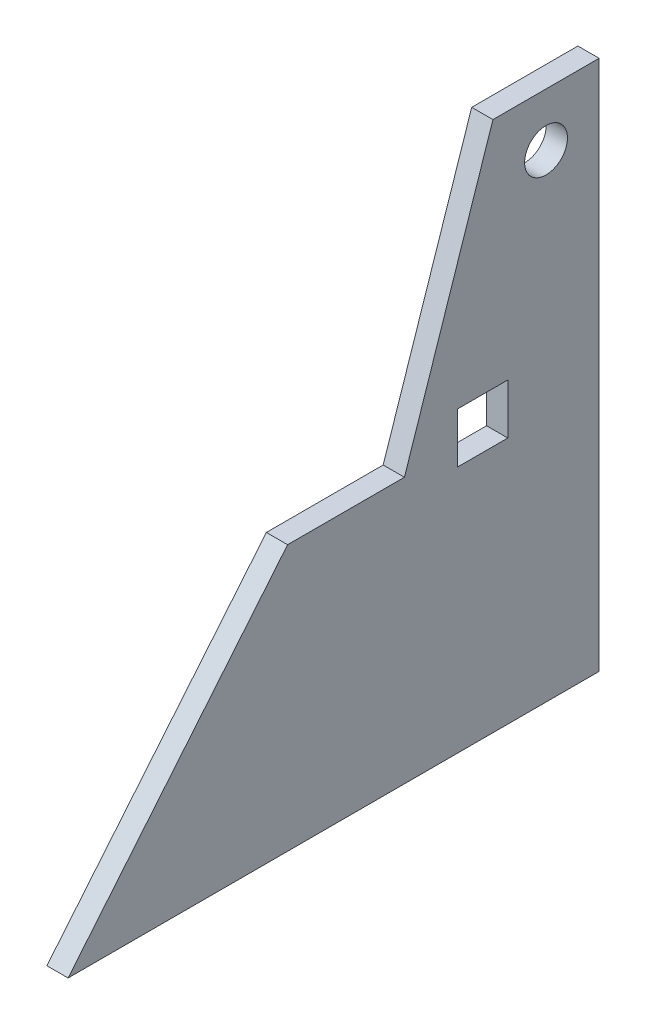
ISO-10303-21;
HEADER;
FILE_DESCRIPTION(('STEP AP214'),'2;1');
FILE_NAME('part.step','',(''),(''),'','','');
FILE_SCHEMA(('AUTOMOTIVE_DESIGN { 1 0 10303 214 1 1 1 1 }'));
ENDSEC;
DATA;
#1=APPLICATION_CONTEXT('core data for automotive mechanical design processes');
#2=APPLICATION_PROTOCOL_DEFINITION('international standard','automotive_design',2000,#1);
#3=PRODUCT_CONTEXT('',#1,'mechanical');
#4=PRODUCT('Part','Part','',(#3));
#5=PRODUCT_RELATED_PRODUCT_CATEGORY('part','',(#4));
#6=PRODUCT_DEFINITION_FORMATION('','',#4);
#7=PRODUCT_DEFINITION_CONTEXT('part definition',#1,'design');
#8=PRODUCT_DEFINITION('design','',#6,#7);
#9=PRODUCT_DEFINITION_SHAPE('','',#8);
#10=(LENGTH_UNIT() NAMED_UNIT(*) SI_UNIT(.MILLI.,.METRE.));
#11=(NAMED_UNIT(*) PLANE_ANGLE_UNIT() SI_UNIT($,.RADIAN.));
#12=(NAMED_UNIT(*) SI_UNIT($,.STERADIAN.) SOLID_ANGLE_UNIT());
#13=UNCERTAINTY_MEASURE_WITH_UNIT(LENGTH_MEASURE(1.E-05),#10,'distance_accuracy_value','');
#14=(GEOMETRIC_REPRESENTATION_CONTEXT(3) GLOBAL_UNCERTAINTY_ASSIGNED_CONTEXT((#13)) GLOBAL_UNIT_ASSIGNED_CONTEXT((#10,
#11,#12)) REPRESENTATION_CONTEXT('',''));
#15=CARTESIAN_POINT('',(0.,0.,0.));
#16=DIRECTION('',(0.,0.,1.));
#17=DIRECTION('',(1.,0.,0.));
#18=AXIS2_PLACEMENT_3D('',#15,#16,#17);
#19=CARTESIAN_POINT('',(6.,0.,0.));
#20=DIRECTION('',(-1.,0.,0.));
#21=DIRECTION('',(0.,0.,1.));
#22=AXIS2_PLACEMENT_3D('',#19,#20,#21);
#23=PLANE('',#22);
#24=DIRECTION('',(0.,1.,0.));
#25=VECTOR('',#24,1.);
#26=CARTESIAN_POINT('',(6.,0.,0.));
#27=LINE('',#26,#25);
#28=CARTESIAN_POINT('',(6.,0.,0.));
#29=VERTEX_POINT('',#28);
#30=CARTESIAN_POINT('',(6.,150.,0.));
#31=VERTEX_POINT('',#30);
#32=EDGE_CURVE('E151',#29,#31,#27,.T.);
#33=ORIENTED_EDGE('',*,*,#32,.T.);
#34=DIRECTION('',(0.,0.,1.));
#35=VECTOR('',#34,1.);
#36=CARTESIAN_POINT('',(6.,150.,30.));
#37=LINE('',#36,#35);
#38=CARTESIAN_POINT('',(6.,150.,30.));
#39=VERTEX_POINT('',#38);
#40=EDGE_CURVE('E154',#31,#39,#37,.T.);
#41=ORIENTED_EDGE('',*,*,#40,.T.);
#42=DIRECTION('',(0.,-0.948683298050514,0.316227766016838));
#43=VECTOR('',#42,1.);
#44=CARTESIAN_POINT('',(6.,150.,30.));
#45=LINE('',#44,#43);
#46=CARTESIAN_POINT('',(6.,75.,55.));
#47=VERTEX_POINT('',#46);
#48=EDGE_CURVE('E157',#39,#47,#45,.T.);
#49=ORIENTED_EDGE('',*,*,#48,.T.);
#50=DIRECTION('',(0.,0.,1.));
#51=VECTOR('',#50,1.);
#52=CARTESIAN_POINT('',(6.,75.,55.));
#53=LINE('',#52,#51);
#54=CARTESIAN_POINT('',(6.,75.,88.));
#55=VERTEX_POINT('',#54);
#56=EDGE_CURVE('E159',#47,#55,#53,.T.);
#57=ORIENTED_EDGE('',*,*,#56,.T.);
#58=DIRECTION('',(0.,-0.770742318559135,0.637146983342218));
#59=VECTOR('',#58,1.);
#60=CARTESIAN_POINT('',(6.,0.,150.));
#61=LINE('',#60,#59);
#62=CARTESIAN_POINT('',(6.,0.,150.));
#63=VERTEX_POINT('',#62);
#64=EDGE_CURVE('E161',#55,#63,#61,.T.);
#65=ORIENTED_EDGE('',*,*,#64,.T.);
#66=DIRECTION('',(0.,0.,-1.));
#67=VECTOR('',#66,1.);
#68=CARTESIAN_POINT('',(6.,0.,150.));
#69=LINE('',#68,#67);
#70=EDGE_CURVE('E163',#63,#29,#69,.T.);
#71=ORIENTED_EDGE('',*,*,#70,.T.);
#72=EDGE_LOOP('',(#33,#41,#49,#57,#65,#71));
#73=FACE_BOUND('',#72,.T.);
#74=DIRECTION('',(0.,-1.,0.));
#75=VECTOR('',#74,1.);
#76=CARTESIAN_POINT('',(6.,70.,40.));
#77=LINE('',#76,#75);
#78=CARTESIAN_POINT('',(6.,84.2,40.));
#79=VERTEX_POINT('',#78);
#80=CARTESIAN_POINT('',(6.,70.,40.));
#81=VERTEX_POINT('',#80);
#82=EDGE_CURVE('E112',#79,#81,#77,.T.);
#83=ORIENTED_EDGE('',*,*,#82,.F.);
#84=DIRECTION('',(0.,0.,1.));
#85=VECTOR('',#84,1.);
#86=CARTESIAN_POINT('',(6.,84.2,25.8));
#87=LINE('',#86,#85);
#88=CARTESIAN_POINT('',(6.,84.2,25.8));
#89=VERTEX_POINT('',#88);
#90=EDGE_CURVE('E135',#89,#79,#87,.T.);
#91=ORIENTED_EDGE('',*,*,#90,.F.);
#92=DIRECTION('',(0.,1.,0.));
#93=VECTOR('',#92,1.);
#94=CARTESIAN_POINT('',(6.,70.,25.8));
#95=LINE('',#94,#93);
#96=CARTESIAN_POINT('',(6.,70.,25.8));
#97=VERTEX_POINT('',#96);
#98=EDGE_CURVE('E133',#97,#89,#95,.T.);
#99=ORIENTED_EDGE('',*,*,#98,.F.);
#100=DIRECTION('',(0.,0.,-1.));
#101=VECTOR('',#100,1.);
#102=CARTESIAN_POINT('',(6.,70.,25.8));
#103=LINE('',#102,#101);
#104=EDGE_CURVE('E120',#81,#97,#103,.T.);
#105=ORIENTED_EDGE('',*,*,#104,.F.);
#106=EDGE_LOOP('',(#83,#91,#99,#105));
#107=FACE_BOUND('',#106,.T.);
#108=CARTESIAN_POINT('',(6.,135.,15.));
#109=DIRECTION('',(1.,0.,0.));
#110=DIRECTION('',(0.,0.,-1.));
#111=AXIS2_PLACEMENT_3D('',#108,#109,#110);
#112=CIRCLE('',#111,6.05);
#113=CARTESIAN_POINT('',(6.,135.,8.95));
#114=VERTEX_POINT('',#113);
#115=EDGE_CURVE('E141',#114,#114,#112,.T.);
#116=ORIENTED_EDGE('',*,*,#115,.F.);
#117=EDGE_LOOP('',(#116));
#118=FACE_BOUND('',#117,.T.);
#119=ADVANCED_FACE('F35',(#73,#107,#118),#23,.F.);
#120=CARTESIAN_POINT('',(0.,0.,0.));
#121=DIRECTION('',(-1.,0.,0.));
#122=DIRECTION('',(0.,0.,1.));
#123=AXIS2_PLACEMENT_3D('',#120,#121,#122);
#124=PLANE('',#123);
#125=DIRECTION('',(0.,0.,1.));
#126=VECTOR('',#125,1.);
#127=CARTESIAN_POINT('',(0.,84.2,25.8));
#128=LINE('',#127,#126);
#129=CARTESIAN_POINT('',(0.,84.2,25.8));
#130=VERTEX_POINT('',#129);
#131=CARTESIAN_POINT('',(0.,84.2,40.));
#132=VERTEX_POINT('',#131);
#133=EDGE_CURVE('E121',#130,#132,#128,.T.);
#134=ORIENTED_EDGE('',*,*,#133,.T.);
#135=DIRECTION('',(0.,-1.,0.));
#136=VECTOR('',#135,1.);
#137=CARTESIAN_POINT('',(0.,70.,40.));
#138=LINE('',#137,#136);
#139=CARTESIAN_POINT('',(0.,70.,40.));
#140=VERTEX_POINT('',#139);
#141=EDGE_CURVE('E58',#132,#140,#138,.T.);
#142=ORIENTED_EDGE('',*,*,#141,.T.);
#143=DIRECTION('',(0.,0.,-1.));
#144=VECTOR('',#143,1.);
#145=CARTESIAN_POINT('',(0.,70.,25.8));
#146=LINE('',#145,#144);
#147=CARTESIAN_POINT('',(0.,70.,25.8));
#148=VERTEX_POINT('',#147);
#149=EDGE_CURVE('E127',#140,#148,#146,.T.);
#150=ORIENTED_EDGE('',*,*,#149,.T.);
#151=DIRECTION('',(0.,1.,0.));
#152=VECTOR('',#151,1.);
#153=CARTESIAN_POINT('',(0.,70.,25.8));
#154=LINE('',#153,#152);
#155=EDGE_CURVE('E143',#148,#130,#154,.T.);
#156=ORIENTED_EDGE('',*,*,#155,.T.);
#157=EDGE_LOOP('',(#134,#142,#150,#156));
#158=FACE_BOUND('',#157,.T.);
#159=DIRECTION('',(0.,1.,0.));
#160=VECTOR('',#159,1.);
#161=CARTESIAN_POINT('',(0.,0.,0.));
#162=LINE('',#161,#160);
#163=CARTESIAN_POINT('',(0.,0.,0.));
#164=VERTEX_POINT('',#163);
#165=CARTESIAN_POINT('',(0.,150.,0.));
#166=VERTEX_POINT('',#165);
#167=EDGE_CURVE('E128',#164,#166,#162,.T.);
#168=ORIENTED_EDGE('',*,*,#167,.F.);
#169=DIRECTION('',(0.,0.,-1.));
#170=VECTOR('',#169,1.);
#171=CARTESIAN_POINT('',(0.,0.,150.));
#172=LINE('',#171,#170);
#173=CARTESIAN_POINT('',(0.,0.,150.));
#174=VERTEX_POINT('',#173);
#175=EDGE_CURVE('E155',#174,#164,#172,.T.);
#176=ORIENTED_EDGE('',*,*,#175,.F.);
#177=DIRECTION('',(0.,-0.770742318559135,0.637146983342218));
#178=VECTOR('',#177,1.);
#179=CARTESIAN_POINT('',(0.,0.,150.));
#180=LINE('',#179,#178);
#181=CARTESIAN_POINT('',(0.,75.,88.));
#182=VERTEX_POINT('',#181);
#183=EDGE_CURVE('E174',#182,#174,#180,.T.);
#184=ORIENTED_EDGE('',*,*,#183,.F.);
#185=DIRECTION('',(0.,0.,1.));
#186=VECTOR('',#185,1.);
#187=CARTESIAN_POINT('',(0.,75.,55.));
#188=LINE('',#187,#186);
#189=CARTESIAN_POINT('',(0.,75.,55.));
#190=VERTEX_POINT('',#189);
#191=EDGE_CURVE('E172',#190,#182,#188,.T.);
#192=ORIENTED_EDGE('',*,*,#191,.F.);
#193=DIRECTION('',(0.,-0.948683298050514,0.316227766016838));
#194=VECTOR('',#193,1.);
#195=CARTESIAN_POINT('',(0.,150.,30.));
#196=LINE('',#195,#194);
#197=CARTESIAN_POINT('',(0.,150.,30.));
#198=VERTEX_POINT('',#197);
#199=EDGE_CURVE('E170',#198,#190,#196,.T.);
#200=ORIENTED_EDGE('',*,*,#199,.F.);
#201=DIRECTION('',(0.,0.,1.));
#202=VECTOR('',#201,1.);
#203=CARTESIAN_POINT('',(0.,150.,30.));
#204=LINE('',#203,#202);
#205=EDGE_CURVE('E168',#166,#198,#204,.T.);
#206=ORIENTED_EDGE('',*,*,#205,.F.);
#207=EDGE_LOOP('',(#168,#176,#184,#192,#200,#206));
#208=FACE_BOUND('',#207,.T.);
#209=CARTESIAN_POINT('',(0.,135.,15.));
#210=DIRECTION('',(1.,0.,0.));
#211=DIRECTION('',(0.,0.,-1.));
#212=AXIS2_PLACEMENT_3D('',#209,#210,#211);
#213=CIRCLE('',#212,6.05);
#214=CARTESIAN_POINT('',(0.,135.,8.95));
#215=VERTEX_POINT('',#214);
#216=EDGE_CURVE('E254',#215,#215,#213,.T.);
#217=ORIENTED_EDGE('',*,*,#216,.T.);
#218=EDGE_LOOP('',(#217));
#219=FACE_BOUND('',#218,.T.);
#220=ADVANCED_FACE('F198',(#158,#208,#219),#124,.T.);
#221=CARTESIAN_POINT('',(6.,0.,0.));
#222=DIRECTION('',(0.,0.,1.));
#223=DIRECTION('',(1.,0.,0.));
#224=AXIS2_PLACEMENT_3D('',#221,#222,#223);
#225=PLANE('',#224);
#226=ORIENTED_EDGE('',*,*,#167,.T.);
#227=DIRECTION('',(-1.,0.,0.));
#228=VECTOR('',#227,1.);
#229=CARTESIAN_POINT('',(6.,150.,0.));
#230=LINE('',#229,#228);
#231=EDGE_CURVE('E11',#31,#166,#230,.T.);
#232=ORIENTED_EDGE('',*,*,#231,.F.);
#233=ORIENTED_EDGE('',*,*,#32,.F.);
#234=DIRECTION('',(-1.,0.,0.));
#235=VECTOR('',#234,1.);
#236=CARTESIAN_POINT('',(6.,0.,0.));
#237=LINE('',#236,#235);
#238=EDGE_CURVE('E165',#29,#164,#237,.T.);
#239=ORIENTED_EDGE('',*,*,#238,.T.);
#240=EDGE_LOOP('',(#226,#232,#233,#239));
#241=FACE_BOUND('',#240,.T.);
#242=ADVANCED_FACE('F37',(#241),#225,.F.);
#243=CARTESIAN_POINT('',(6.,150.,30.));
#244=DIRECTION('',(0.,-1.,0.));
#245=DIRECTION('',(0.,0.,-1.));
#246=AXIS2_PLACEMENT_3D('',#243,#244,#245);
#247=PLANE('',#246);
#248=ORIENTED_EDGE('',*,*,#205,.T.);
#249=DIRECTION('',(-1.,0.,0.));
#250=VECTOR('',#249,1.);
#251=CARTESIAN_POINT('',(6.,150.,30.));
#252=LINE('',#251,#250);
#253=EDGE_CURVE('E43',#39,#198,#252,.T.);
#254=ORIENTED_EDGE('',*,*,#253,.F.);
#255=ORIENTED_EDGE('',*,*,#40,.F.);
#256=ORIENTED_EDGE('',*,*,#231,.T.);
#257=EDGE_LOOP('',(#248,#254,#255,#256));
#258=FACE_BOUND('',#257,.T.);
#259=ADVANCED_FACE('F215',(#258),#247,.F.);
#260=CARTESIAN_POINT('',(6.,150.,30.));
#261=DIRECTION('',(0.,-0.316227766016838,-0.948683298050514));
#262=DIRECTION('',(0.,0.948683298050514,-0.316227766016838));
#263=AXIS2_PLACEMENT_3D('',#260,#261,#262);
#264=PLANE('',#263);
#265=ORIENTED_EDGE('',*,*,#199,.T.);
#266=DIRECTION('',(-1.,0.,0.));
#267=VECTOR('',#266,1.);
#268=CARTESIAN_POINT('',(6.,75.,55.));
#269=LINE('',#268,#267);
#270=EDGE_CURVE('E185',#47,#190,#269,.T.);
#271=ORIENTED_EDGE('',*,*,#270,.F.);
#272=ORIENTED_EDGE('',*,*,#48,.F.);
#273=ORIENTED_EDGE('',*,*,#253,.T.);
#274=EDGE_LOOP('',(#265,#271,#272,#273));
#275=FACE_BOUND('',#274,.T.);
#276=ADVANCED_FACE('F192',(#275),#264,.F.);
#277=CARTESIAN_POINT('',(6.,75.,55.));
#278=DIRECTION('',(0.,-1.,0.));
#279=DIRECTION('',(0.,0.,-1.));
#280=AXIS2_PLACEMENT_3D('',#277,#278,#279);
#281=PLANE('',#280);
#282=ORIENTED_EDGE('',*,*,#191,.T.);
#283=DIRECTION('',(-1.,0.,0.));
#284=VECTOR('',#283,1.);
#285=CARTESIAN_POINT('',(6.,75.,88.));
#286=LINE('',#285,#284);
#287=EDGE_CURVE('E182',#55,#182,#286,.T.);
#288=ORIENTED_EDGE('',*,*,#287,.F.);
#289=ORIENTED_EDGE('',*,*,#56,.F.);
#290=ORIENTED_EDGE('',*,*,#270,.T.);
#291=EDGE_LOOP('',(#282,#288,#289,#290));
#292=FACE_BOUND('',#291,.T.);
#293=ADVANCED_FACE('F204',(#292),#281,.F.);
#294=CARTESIAN_POINT('',(6.,0.,150.));
#295=DIRECTION('',(0.,-0.637146983342218,-0.770742318559135));
#296=DIRECTION('',(0.,0.770742318559135,-0.637146983342218));
#297=AXIS2_PLACEMENT_3D('',#294,#295,#296);
#298=PLANE('',#297);
#299=ORIENTED_EDGE('',*,*,#183,.T.);
#300=DIRECTION('',(-1.,0.,0.));
#301=VECTOR('',#300,1.);
#302=CARTESIAN_POINT('',(6.,0.,150.));
#303=LINE('',#302,#301);
#304=EDGE_CURVE('E179',#63,#174,#303,.T.);
#305=ORIENTED_EDGE('',*,*,#304,.F.);
#306=ORIENTED_EDGE('',*,*,#64,.F.);
#307=ORIENTED_EDGE('',*,*,#287,.T.);
#308=EDGE_LOOP('',(#299,#305,#306,#307));
#309=FACE_BOUND('',#308,.T.);
#310=ADVANCED_FACE('F208',(#309),#298,.F.);
#311=CARTESIAN_POINT('',(6.,0.,150.));
#312=DIRECTION('',(0.,1.,0.));
#313=DIRECTION('',(0.,0.,1.));
#314=AXIS2_PLACEMENT_3D('',#311,#312,#313);
#315=PLANE('',#314);
#316=ORIENTED_EDGE('',*,*,#175,.T.);
#317=ORIENTED_EDGE('',*,*,#238,.F.);
#318=ORIENTED_EDGE('',*,*,#70,.F.);
#319=ORIENTED_EDGE('',*,*,#304,.T.);
#320=EDGE_LOOP('',(#316,#317,#318,#319));
#321=FACE_BOUND('',#320,.T.);
#322=ADVANCED_FACE('F218',(#321),#315,.F.);
#323=CARTESIAN_POINT('',(6.,70.,40.));
#324=DIRECTION('',(0.,0.,-1.));
#325=DIRECTION('',(-1.,0.,0.));
#326=AXIS2_PLACEMENT_3D('',#323,#324,#325);
#327=PLANE('',#326);
#328=ORIENTED_EDGE('',*,*,#141,.F.);
#329=DIRECTION('',(-1.,0.,0.));
#330=VECTOR('',#329,1.);
#331=CARTESIAN_POINT('',(6.,84.2,40.));
#332=LINE('',#331,#330);
#333=EDGE_CURVE('E116',#79,#132,#332,.T.);
#334=ORIENTED_EDGE('',*,*,#333,.F.);
#335=ORIENTED_EDGE('',*,*,#82,.T.);
#336=DIRECTION('',(-1.,0.,0.));
#337=VECTOR('',#336,1.);
#338=CARTESIAN_POINT('',(6.,70.,40.));
#339=LINE('',#338,#337);
#340=EDGE_CURVE('E115',#81,#140,#339,.T.);
#341=ORIENTED_EDGE('',*,*,#340,.T.);
#342=EDGE_LOOP('',(#328,#334,#335,#341));
#343=FACE_BOUND('',#342,.T.);
#344=ADVANCED_FACE('F114',(#343),#327,.T.);
#345=CARTESIAN_POINT('',(6.,70.,25.8));
#346=DIRECTION('',(0.,1.,0.));
#347=DIRECTION('',(0.,0.,1.));
#348=AXIS2_PLACEMENT_3D('',#345,#346,#347);
#349=PLANE('',#348);
#350=ORIENTED_EDGE('',*,*,#149,.F.);
#351=ORIENTED_EDGE('',*,*,#340,.F.);
#352=ORIENTED_EDGE('',*,*,#104,.T.);
#353=DIRECTION('',(-1.,0.,0.));
#354=VECTOR('',#353,1.);
#355=CARTESIAN_POINT('',(6.,70.,25.8));
#356=LINE('',#355,#354);
#357=EDGE_CURVE('E129',#97,#148,#356,.T.);
#358=ORIENTED_EDGE('',*,*,#357,.T.);
#359=EDGE_LOOP('',(#350,#351,#352,#358));
#360=FACE_BOUND('',#359,.T.);
#361=ADVANCED_FACE('F124',(#360),#349,.T.);
#362=CARTESIAN_POINT('',(6.,70.,25.8));
#363=DIRECTION('',(0.,0.,1.));
#364=DIRECTION('',(1.,0.,0.));
#365=AXIS2_PLACEMENT_3D('',#362,#363,#364);
#366=PLANE('',#365);
#367=ORIENTED_EDGE('',*,*,#155,.F.);
#368=ORIENTED_EDGE('',*,*,#357,.F.);
#369=ORIENTED_EDGE('',*,*,#98,.T.);
#370=DIRECTION('',(-1.,0.,0.));
#371=VECTOR('',#370,1.);
#372=CARTESIAN_POINT('',(6.,84.2,25.8));
#373=LINE('',#372,#371);
#374=EDGE_CURVE('E50',#89,#130,#373,.T.);
#375=ORIENTED_EDGE('',*,*,#374,.T.);
#376=EDGE_LOOP('',(#367,#368,#369,#375));
#377=FACE_BOUND('',#376,.T.);
#378=ADVANCED_FACE('F237',(#377),#366,.T.);
#379=CARTESIAN_POINT('',(6.,84.2,25.8));
#380=DIRECTION('',(0.,-1.,0.));
#381=DIRECTION('',(0.,0.,-1.));
#382=AXIS2_PLACEMENT_3D('',#379,#380,#381);
#383=PLANE('',#382);
#384=ORIENTED_EDGE('',*,*,#133,.F.);
#385=ORIENTED_EDGE('',*,*,#374,.F.);
#386=ORIENTED_EDGE('',*,*,#90,.T.);
#387=ORIENTED_EDGE('',*,*,#333,.T.);
#388=EDGE_LOOP('',(#384,#385,#386,#387));
#389=FACE_BOUND('',#388,.T.);
#390=ADVANCED_FACE('F240',(#389),#383,.T.);
#391=CARTESIAN_POINT('',(6.,135.,15.));
#392=DIRECTION('',(-1.,0.,0.));
#393=DIRECTION('',(0.,0.,1.));
#394=AXIS2_PLACEMENT_3D('',#391,#392,#393);
#395=CYLINDRICAL_SURFACE('',#394,6.05);
#396=ORIENTED_EDGE('',*,*,#115,.T.);
#397=EDGE_LOOP('',(#396));
#398=FACE_BOUND('',#397,.T.);
#399=ORIENTED_EDGE('',*,*,#216,.F.);
#400=EDGE_LOOP('',(#399));
#401=FACE_BOUND('',#400,.T.);
#402=ADVANCED_FACE('F244',(#398,#401),#395,.F.);
#403=CLOSED_SHELL('',(#119,#220,#242,#259,#276,#293,#310,#322,#344,#361,#378,#390,#402));
#404=MANIFOLD_SOLID_BREP('B2',#403);
#405=ADVANCED_BREP_SHAPE_REPRESENTATION('',(#18,#404),#14);
#406=SHAPE_DEFINITION_REPRESENTATION(#9,#405);
ENDSEC;
END-ISO-10303-21;
